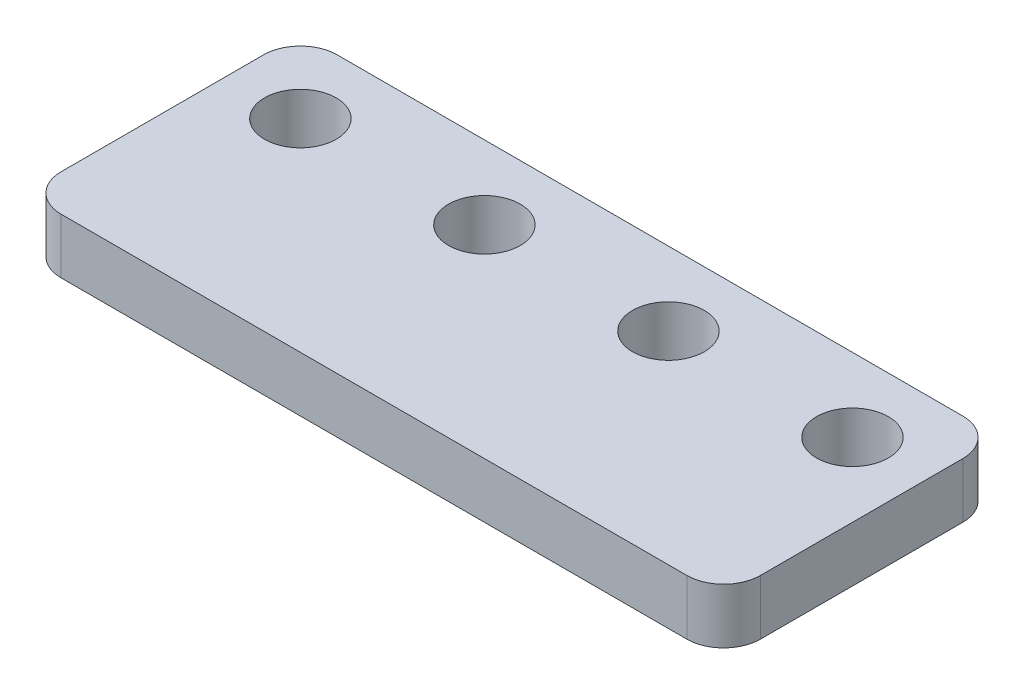
ISO-10303-21;
HEADER;
FILE_DESCRIPTION(('STEP AP214'),'2;1');
FILE_NAME('part.step','',(''),(''),'','','');
FILE_SCHEMA(('AUTOMOTIVE_DESIGN { 1 0 10303 214 1 1 1 1 }'));
ENDSEC;
DATA;
#1=APPLICATION_CONTEXT('core data for automotive mechanical design processes');
#2=APPLICATION_PROTOCOL_DEFINITION('international standard','automotive_design',2000,#1);
#3=PRODUCT_CONTEXT('',#1,'mechanical');
#4=PRODUCT('Part','Part','',(#3));
#5=PRODUCT_RELATED_PRODUCT_CATEGORY('part','',(#4));
#6=PRODUCT_DEFINITION_FORMATION('','',#4);
#7=PRODUCT_DEFINITION_CONTEXT('part definition',#1,'design');
#8=PRODUCT_DEFINITION('design','',#6,#7);
#9=PRODUCT_DEFINITION_SHAPE('','',#8);
#10=(LENGTH_UNIT() NAMED_UNIT(*) SI_UNIT(.MILLI.,.METRE.));
#11=(NAMED_UNIT(*) PLANE_ANGLE_UNIT() SI_UNIT($,.RADIAN.));
#12=(NAMED_UNIT(*) SI_UNIT($,.STERADIAN.) SOLID_ANGLE_UNIT());
#13=UNCERTAINTY_MEASURE_WITH_UNIT(LENGTH_MEASURE(1.E-05),#10,'distance_accuracy_value','');
#14=(GEOMETRIC_REPRESENTATION_CONTEXT(3) GLOBAL_UNCERTAINTY_ASSIGNED_CONTEXT((#13)) GLOBAL_UNIT_ASSIGNED_CONTEXT((#10,
#11,#12)) REPRESENTATION_CONTEXT('',''));
#15=CARTESIAN_POINT('',(0.,0.,0.));
#16=DIRECTION('',(0.,0.,1.));
#17=DIRECTION('',(1.,0.,0.));
#18=AXIS2_PLACEMENT_3D('',#15,#16,#17);
#19=CARTESIAN_POINT('',(-2.,3.,13.));
#20=DIRECTION('',(0.,-1.,0.));
#21=DIRECTION('',(0.,0.,-1.));
#22=AXIS2_PLACEMENT_3D('',#19,#20,#21);
#23=CYLINDRICAL_SURFACE('',#22,2.);
#24=CARTESIAN_POINT('',(-2.,0.,13.));
#25=DIRECTION('',(0.,1.,0.));
#26=DIRECTION('',(0.,0.,1.));
#27=AXIS2_PLACEMENT_3D('',#24,#25,#26);
#28=CIRCLE('',#27,2.);
#29=CARTESIAN_POINT('',(-2.,0.,15.));
#30=VERTEX_POINT('',#29);
#31=CARTESIAN_POINT('',(0.,0.,13.));
#32=VERTEX_POINT('',#31);
#33=EDGE_CURVE('E129',#30,#32,#28,.T.);
#34=ORIENTED_EDGE('',*,*,#33,.T.);
#35=DIRECTION('',(0.,-1.,0.));
#36=VECTOR('',#35,1.);
#37=CARTESIAN_POINT('',(0.,3.,13.));
#38=LINE('',#37,#36);
#39=CARTESIAN_POINT('',(0.,3.,13.));
#40=VERTEX_POINT('',#39);
#41=EDGE_CURVE('E11',#40,#32,#38,.T.);
#42=ORIENTED_EDGE('',*,*,#41,.F.);
#43=CARTESIAN_POINT('',(-2.,3.,13.));
#44=DIRECTION('',(0.,1.,0.));
#45=DIRECTION('',(0.,0.,1.));
#46=AXIS2_PLACEMENT_3D('',#43,#44,#45);
#47=CIRCLE('',#46,2.);
#48=CARTESIAN_POINT('',(-2.,3.,15.));
#49=VERTEX_POINT('',#48);
#50=EDGE_CURVE('E144',#49,#40,#47,.T.);
#51=ORIENTED_EDGE('',*,*,#50,.F.);
#52=DIRECTION('',(0.,-1.,0.));
#53=VECTOR('',#52,1.);
#54=CARTESIAN_POINT('',(-2.,3.,15.));
#55=LINE('',#54,#53);
#56=EDGE_CURVE('E125',#49,#30,#55,.T.);
#57=ORIENTED_EDGE('',*,*,#56,.T.);
#58=EDGE_LOOP('',(#34,#42,#51,#57));
#59=FACE_BOUND('',#58,.T.);
#60=ADVANCED_FACE('F33',(#59),#23,.T.);
#61=CARTESIAN_POINT('',(0.,3.,2.));
#62=DIRECTION('',(-1.,0.,0.));
#63=DIRECTION('',(0.,0.,1.));
#64=AXIS2_PLACEMENT_3D('',#61,#62,#63);
#65=PLANE('',#64);
#66=DIRECTION('',(0.,0.,-1.));
#67=VECTOR('',#66,1.);
#68=CARTESIAN_POINT('',(0.,0.,2.));
#69=LINE('',#68,#67);
#70=CARTESIAN_POINT('',(0.,0.,2.));
#71=VERTEX_POINT('',#70);
#72=EDGE_CURVE('E132',#32,#71,#69,.T.);
#73=ORIENTED_EDGE('',*,*,#72,.T.);
#74=DIRECTION('',(0.,-1.,0.));
#75=VECTOR('',#74,1.);
#76=CARTESIAN_POINT('',(0.,3.,2.));
#77=LINE('',#76,#75);
#78=CARTESIAN_POINT('',(0.,3.,2.));
#79=VERTEX_POINT('',#78);
#80=EDGE_CURVE('E41',#79,#71,#77,.T.);
#81=ORIENTED_EDGE('',*,*,#80,.F.);
#82=DIRECTION('',(0.,0.,-1.));
#83=VECTOR('',#82,1.);
#84=CARTESIAN_POINT('',(0.,3.,2.));
#85=LINE('',#84,#83);
#86=EDGE_CURVE('E92',#40,#79,#85,.T.);
#87=ORIENTED_EDGE('',*,*,#86,.F.);
#88=ORIENTED_EDGE('',*,*,#41,.T.);
#89=EDGE_LOOP('',(#73,#81,#87,#88));
#90=FACE_BOUND('',#89,.T.);
#91=ADVANCED_FACE('F235',(#90),#65,.F.);
#92=CARTESIAN_POINT('',(-2.,3.,2.));
#93=DIRECTION('',(0.,-1.,0.));
#94=DIRECTION('',(0.,0.,-1.));
#95=AXIS2_PLACEMENT_3D('',#92,#93,#94);
#96=CYLINDRICAL_SURFACE('',#95,2.);
#97=CARTESIAN_POINT('',(-2.,0.,2.));
#98=DIRECTION('',(0.,1.,0.));
#99=DIRECTION('',(0.,0.,-1.));
#100=AXIS2_PLACEMENT_3D('',#97,#98,#99);
#101=CIRCLE('',#100,2.);
#102=CARTESIAN_POINT('',(-2.,0.,0.));
#103=VERTEX_POINT('',#102);
#104=EDGE_CURVE('E135',#71,#103,#101,.T.);
#105=ORIENTED_EDGE('',*,*,#104,.T.);
#106=DIRECTION('',(0.,-1.,0.));
#107=VECTOR('',#106,1.);
#108=CARTESIAN_POINT('',(-2.,3.,0.));
#109=LINE('',#108,#107);
#110=CARTESIAN_POINT('',(-2.,3.,0.));
#111=VERTEX_POINT('',#110);
#112=EDGE_CURVE('E151',#111,#103,#109,.T.);
#113=ORIENTED_EDGE('',*,*,#112,.F.);
#114=CARTESIAN_POINT('',(-2.,3.,2.));
#115=DIRECTION('',(0.,1.,0.));
#116=DIRECTION('',(0.,0.,-1.));
#117=AXIS2_PLACEMENT_3D('',#114,#115,#116);
#118=CIRCLE('',#117,2.);
#119=EDGE_CURVE('E159',#79,#111,#118,.T.);
#120=ORIENTED_EDGE('',*,*,#119,.F.);
#121=ORIENTED_EDGE('',*,*,#80,.T.);
#122=EDGE_LOOP('',(#105,#113,#120,#121));
#123=FACE_BOUND('',#122,.T.);
#124=ADVANCED_FACE('F157',(#123),#96,.T.);
#125=CARTESIAN_POINT('',(-36.,3.,0.));
#126=DIRECTION('',(0.,0.,1.));
#127=DIRECTION('',(1.,0.,0.));
#128=AXIS2_PLACEMENT_3D('',#125,#126,#127);
#129=PLANE('',#128);
#130=DIRECTION('',(-1.,0.,0.));
#131=VECTOR('',#130,1.);
#132=CARTESIAN_POINT('',(-36.,0.,0.));
#133=LINE('',#132,#131);
#134=CARTESIAN_POINT('',(-36.,0.,0.));
#135=VERTEX_POINT('',#134);
#136=EDGE_CURVE('E137',#103,#135,#133,.T.);
#137=ORIENTED_EDGE('',*,*,#136,.T.);
#138=DIRECTION('',(0.,-1.,0.));
#139=VECTOR('',#138,1.);
#140=CARTESIAN_POINT('',(-36.,3.,0.));
#141=LINE('',#140,#139);
#142=CARTESIAN_POINT('',(-36.,3.,0.));
#143=VERTEX_POINT('',#142);
#144=EDGE_CURVE('E148',#143,#135,#141,.T.);
#145=ORIENTED_EDGE('',*,*,#144,.F.);
#146=DIRECTION('',(-1.,0.,0.));
#147=VECTOR('',#146,1.);
#148=CARTESIAN_POINT('',(-36.,3.,0.));
#149=LINE('',#148,#147);
#150=EDGE_CURVE('E171',#111,#143,#149,.T.);
#151=ORIENTED_EDGE('',*,*,#150,.F.);
#152=ORIENTED_EDGE('',*,*,#112,.T.);
#153=EDGE_LOOP('',(#137,#145,#151,#152));
#154=FACE_BOUND('',#153,.T.);
#155=ADVANCED_FACE('F167',(#154),#129,.F.);
#156=CARTESIAN_POINT('',(-36.,3.,2.));
#157=DIRECTION('',(0.,-1.,0.));
#158=DIRECTION('',(0.,0.,-1.));
#159=AXIS2_PLACEMENT_3D('',#156,#157,#158);
#160=CYLINDRICAL_SURFACE('',#159,2.);
#161=CARTESIAN_POINT('',(-36.,0.,2.));
#162=DIRECTION('',(0.,1.,0.));
#163=DIRECTION('',(0.,0.,1.));
#164=AXIS2_PLACEMENT_3D('',#161,#162,#163);
#165=CIRCLE('',#164,2.);
#166=CARTESIAN_POINT('',(-38.,0.,2.));
#167=VERTEX_POINT('',#166);
#168=EDGE_CURVE('E139',#135,#167,#165,.T.);
#169=ORIENTED_EDGE('',*,*,#168,.T.);
#170=DIRECTION('',(0.,-1.,0.));
#171=VECTOR('',#170,1.);
#172=CARTESIAN_POINT('',(-38.,3.,2.));
#173=LINE('',#172,#171);
#174=CARTESIAN_POINT('',(-38.,3.,2.));
#175=VERTEX_POINT('',#174);
#176=EDGE_CURVE('E120',#175,#167,#173,.T.);
#177=ORIENTED_EDGE('',*,*,#176,.F.);
#178=CARTESIAN_POINT('',(-36.,3.,2.));
#179=DIRECTION('',(0.,1.,0.));
#180=DIRECTION('',(0.,0.,1.));
#181=AXIS2_PLACEMENT_3D('',#178,#179,#180);
#182=CIRCLE('',#181,2.);
#183=EDGE_CURVE('E111',#143,#175,#182,.T.);
#184=ORIENTED_EDGE('',*,*,#183,.F.);
#185=ORIENTED_EDGE('',*,*,#144,.T.);
#186=EDGE_LOOP('',(#169,#177,#184,#185));
#187=FACE_BOUND('',#186,.T.);
#188=ADVANCED_FACE('F170',(#187),#160,.T.);
#189=CARTESIAN_POINT('',(-38.,3.,2.));
#190=DIRECTION('',(1.,0.,0.));
#191=DIRECTION('',(0.,0.,-1.));
#192=AXIS2_PLACEMENT_3D('',#189,#190,#191);
#193=PLANE('',#192);
#194=DIRECTION('',(0.,0.,1.));
#195=VECTOR('',#194,1.);
#196=CARTESIAN_POINT('',(-38.,0.,2.));
#197=LINE('',#196,#195);
#198=CARTESIAN_POINT('',(-38.,0.,13.));
#199=VERTEX_POINT('',#198);
#200=EDGE_CURVE('E119',#167,#199,#197,.T.);
#201=ORIENTED_EDGE('',*,*,#200,.T.);
#202=DIRECTION('',(0.,-1.,0.));
#203=VECTOR('',#202,1.);
#204=CARTESIAN_POINT('',(-38.,3.,13.));
#205=LINE('',#204,#203);
#206=CARTESIAN_POINT('',(-38.,3.,13.));
#207=VERTEX_POINT('',#206);
#208=EDGE_CURVE('E116',#207,#199,#205,.T.);
#209=ORIENTED_EDGE('',*,*,#208,.F.);
#210=DIRECTION('',(0.,0.,1.));
#211=VECTOR('',#210,1.);
#212=CARTESIAN_POINT('',(-38.,3.,2.));
#213=LINE('',#212,#211);
#214=EDGE_CURVE('E105',#175,#207,#213,.T.);
#215=ORIENTED_EDGE('',*,*,#214,.F.);
#216=ORIENTED_EDGE('',*,*,#176,.T.);
#217=EDGE_LOOP('',(#201,#209,#215,#216));
#218=FACE_BOUND('',#217,.T.);
#219=ADVANCED_FACE('F117',(#218),#193,.F.);
#220=CARTESIAN_POINT('',(-36.,3.,13.));
#221=DIRECTION('',(0.,-1.,0.));
#222=DIRECTION('',(0.,0.,-1.));
#223=AXIS2_PLACEMENT_3D('',#220,#221,#222);
#224=CYLINDRICAL_SURFACE('',#223,2.);
#225=CARTESIAN_POINT('',(-36.,0.,13.));
#226=DIRECTION('',(0.,1.,0.));
#227=DIRECTION('',(0.,0.,1.));
#228=AXIS2_PLACEMENT_3D('',#225,#226,#227);
#229=CIRCLE('',#228,2.);
#230=CARTESIAN_POINT('',(-36.,0.,15.));
#231=VERTEX_POINT('',#230);
#232=EDGE_CURVE('E78',#199,#231,#229,.T.);
#233=ORIENTED_EDGE('',*,*,#232,.T.);
#234=DIRECTION('',(0.,-1.,0.));
#235=VECTOR('',#234,1.);
#236=CARTESIAN_POINT('',(-36.,3.,15.));
#237=LINE('',#236,#235);
#238=CARTESIAN_POINT('',(-36.,3.,15.));
#239=VERTEX_POINT('',#238);
#240=EDGE_CURVE('E121',#239,#231,#237,.T.);
#241=ORIENTED_EDGE('',*,*,#240,.F.);
#242=CARTESIAN_POINT('',(-36.,3.,13.));
#243=DIRECTION('',(0.,1.,0.));
#244=DIRECTION('',(0.,0.,1.));
#245=AXIS2_PLACEMENT_3D('',#242,#243,#244);
#246=CIRCLE('',#245,2.);
#247=EDGE_CURVE('E109',#207,#239,#246,.T.);
#248=ORIENTED_EDGE('',*,*,#247,.F.);
#249=ORIENTED_EDGE('',*,*,#208,.T.);
#250=EDGE_LOOP('',(#233,#241,#248,#249));
#251=FACE_BOUND('',#250,.T.);
#252=ADVANCED_FACE('F123',(#251),#224,.T.);
#253=CARTESIAN_POINT('',(-36.,3.,15.));
#254=DIRECTION('',(0.,0.,-1.));
#255=DIRECTION('',(-1.,0.,0.));
#256=AXIS2_PLACEMENT_3D('',#253,#254,#255);
#257=PLANE('',#256);
#258=DIRECTION('',(1.,0.,0.));
#259=VECTOR('',#258,1.);
#260=CARTESIAN_POINT('',(-36.,0.,15.));
#261=LINE('',#260,#259);
#262=EDGE_CURVE('E84',#231,#30,#261,.T.);
#263=ORIENTED_EDGE('',*,*,#262,.T.);
#264=ORIENTED_EDGE('',*,*,#56,.F.);
#265=DIRECTION('',(1.,0.,0.));
#266=VECTOR('',#265,1.);
#267=CARTESIAN_POINT('',(-36.,3.,15.));
#268=LINE('',#267,#266);
#269=EDGE_CURVE('E49',#239,#49,#268,.T.);
#270=ORIENTED_EDGE('',*,*,#269,.F.);
#271=ORIENTED_EDGE('',*,*,#240,.T.);
#272=EDGE_LOOP('',(#263,#264,#270,#271));
#273=FACE_BOUND('',#272,.T.);
#274=ADVANCED_FACE('F212',(#273),#257,.F.);
#275=CARTESIAN_POINT('',(-2.,3.,13.));
#276=DIRECTION('',(0.,1.,0.));
#277=DIRECTION('',(0.,0.,1.));
#278=AXIS2_PLACEMENT_3D('',#275,#276,#277);
#279=PLANE('',#278);
#280=CARTESIAN_POINT('',(-4.,3.,4.));
#281=DIRECTION('',(0.,1.,0.));
#282=DIRECTION('',(0.,0.,1.));
#283=AXIS2_PLACEMENT_3D('',#280,#281,#282);
#284=CIRCLE('',#283,1.95);
#285=CARTESIAN_POINT('',(-4.,3.,5.95));
#286=VERTEX_POINT('',#285);
#287=EDGE_CURVE('E190',#286,#286,#284,.T.);
#288=ORIENTED_EDGE('',*,*,#287,.F.);
#289=EDGE_LOOP('',(#288));
#290=FACE_BOUND('',#289,.T.);
#291=CARTESIAN_POINT('',(-34.,3.,4.));
#292=DIRECTION('',(0.,1.,0.));
#293=DIRECTION('',(0.,0.,1.));
#294=AXIS2_PLACEMENT_3D('',#291,#292,#293);
#295=CIRCLE('',#294,1.95);
#296=CARTESIAN_POINT('',(-34.,3.,5.95));
#297=VERTEX_POINT('',#296);
#298=EDGE_CURVE('E191',#297,#297,#295,.T.);
#299=ORIENTED_EDGE('',*,*,#298,.F.);
#300=EDGE_LOOP('',(#299));
#301=FACE_BOUND('',#300,.T.);
#302=CARTESIAN_POINT('',(-24.,3.,4.));
#303=DIRECTION('',(0.,1.,0.));
#304=DIRECTION('',(0.,0.,1.));
#305=AXIS2_PLACEMENT_3D('',#302,#303,#304);
#306=CIRCLE('',#305,1.95);
#307=CARTESIAN_POINT('',(-24.,3.,5.95));
#308=VERTEX_POINT('',#307);
#309=EDGE_CURVE('E177',#308,#308,#306,.T.);
#310=ORIENTED_EDGE('',*,*,#309,.F.);
#311=EDGE_LOOP('',(#310));
#312=FACE_BOUND('',#311,.T.);
#313=CARTESIAN_POINT('',(-14.,3.,4.));
#314=DIRECTION('',(0.,1.,0.));
#315=DIRECTION('',(0.,0.,1.));
#316=AXIS2_PLACEMENT_3D('',#313,#314,#315);
#317=CIRCLE('',#316,1.95);
#318=CARTESIAN_POINT('',(-14.,3.,5.95));
#319=VERTEX_POINT('',#318);
#320=EDGE_CURVE('E184',#319,#319,#317,.T.);
#321=ORIENTED_EDGE('',*,*,#320,.F.);
#322=EDGE_LOOP('',(#321));
#323=FACE_BOUND('',#322,.T.);
#324=ORIENTED_EDGE('',*,*,#50,.T.);
#325=ORIENTED_EDGE('',*,*,#86,.T.);
#326=ORIENTED_EDGE('',*,*,#119,.T.);
#327=ORIENTED_EDGE('',*,*,#150,.T.);
#328=ORIENTED_EDGE('',*,*,#183,.T.);
#329=ORIENTED_EDGE('',*,*,#214,.T.);
#330=ORIENTED_EDGE('',*,*,#247,.T.);
#331=ORIENTED_EDGE('',*,*,#269,.T.);
#332=EDGE_LOOP('',(#324,#325,#326,#327,#328,#329,#330,#331));
#333=FACE_BOUND('',#332,.T.);
#334=ADVANCED_FACE('F107',(#290,#301,#312,#323,#333),#279,.T.);
#335=CARTESIAN_POINT('',(-2.,0.,13.));
#336=DIRECTION('',(0.,1.,0.));
#337=DIRECTION('',(0.,0.,1.));
#338=AXIS2_PLACEMENT_3D('',#335,#336,#337);
#339=PLANE('',#338);
#340=CARTESIAN_POINT('',(-4.,0.,4.));
#341=DIRECTION('',(0.,1.,0.));
#342=DIRECTION('',(0.,0.,1.));
#343=AXIS2_PLACEMENT_3D('',#340,#341,#342);
#344=CIRCLE('',#343,1.95);
#345=CARTESIAN_POINT('',(-4.,0.,5.95));
#346=VERTEX_POINT('',#345);
#347=EDGE_CURVE('E133',#346,#346,#344,.T.);
#348=ORIENTED_EDGE('',*,*,#347,.T.);
#349=EDGE_LOOP('',(#348));
#350=FACE_BOUND('',#349,.T.);
#351=CARTESIAN_POINT('',(-34.,0.,4.));
#352=DIRECTION('',(0.,1.,0.));
#353=DIRECTION('',(0.,0.,1.));
#354=AXIS2_PLACEMENT_3D('',#351,#352,#353);
#355=CIRCLE('',#354,1.95);
#356=CARTESIAN_POINT('',(-34.,0.,5.95));
#357=VERTEX_POINT('',#356);
#358=EDGE_CURVE('E181',#357,#357,#355,.T.);
#359=ORIENTED_EDGE('',*,*,#358,.T.);
#360=EDGE_LOOP('',(#359));
#361=FACE_BOUND('',#360,.T.);
#362=CARTESIAN_POINT('',(-24.,0.,4.));
#363=DIRECTION('',(0.,1.,0.));
#364=DIRECTION('',(0.,0.,1.));
#365=AXIS2_PLACEMENT_3D('',#362,#363,#364);
#366=CIRCLE('',#365,1.95);
#367=CARTESIAN_POINT('',(-24.,0.,5.95));
#368=VERTEX_POINT('',#367);
#369=EDGE_CURVE('E180',#368,#368,#366,.T.);
#370=ORIENTED_EDGE('',*,*,#369,.T.);
#371=EDGE_LOOP('',(#370));
#372=FACE_BOUND('',#371,.T.);
#373=CARTESIAN_POINT('',(-14.,0.,4.));
#374=DIRECTION('',(0.,1.,0.));
#375=DIRECTION('',(0.,0.,1.));
#376=AXIS2_PLACEMENT_3D('',#373,#374,#375);
#377=CIRCLE('',#376,1.95);
#378=CARTESIAN_POINT('',(-14.,0.,5.95));
#379=VERTEX_POINT('',#378);
#380=EDGE_CURVE('E187',#379,#379,#377,.T.);
#381=ORIENTED_EDGE('',*,*,#380,.T.);
#382=EDGE_LOOP('',(#381));
#383=FACE_BOUND('',#382,.T.);
#384=ORIENTED_EDGE('',*,*,#33,.F.);
#385=ORIENTED_EDGE('',*,*,#262,.F.);
#386=ORIENTED_EDGE('',*,*,#232,.F.);
#387=ORIENTED_EDGE('',*,*,#200,.F.);
#388=ORIENTED_EDGE('',*,*,#168,.F.);
#389=ORIENTED_EDGE('',*,*,#136,.F.);
#390=ORIENTED_EDGE('',*,*,#104,.F.);
#391=ORIENTED_EDGE('',*,*,#72,.F.);
#392=EDGE_LOOP('',(#384,#385,#386,#387,#388,#389,#390,#391));
#393=FACE_BOUND('',#392,.T.);
#394=ADVANCED_FACE('F163',(#350,#361,#372,#383,#393),#339,.F.);
#395=CARTESIAN_POINT('',(-14.,0.,4.));
#396=DIRECTION('',(0.,1.,0.));
#397=DIRECTION('',(0.,0.,1.));
#398=AXIS2_PLACEMENT_3D('',#395,#396,#397);
#399=CYLINDRICAL_SURFACE('',#398,1.95);
#400=ORIENTED_EDGE('',*,*,#380,.F.);
#401=EDGE_LOOP('',(#400));
#402=FACE_BOUND('',#401,.T.);
#403=ORIENTED_EDGE('',*,*,#320,.T.);
#404=EDGE_LOOP('',(#403));
#405=FACE_BOUND('',#404,.T.);
#406=ADVANCED_FACE('F220',(#402,#405),#399,.F.);
#407=CARTESIAN_POINT('',(-24.,0.,4.));
#408=DIRECTION('',(0.,1.,0.));
#409=DIRECTION('',(0.,0.,1.));
#410=AXIS2_PLACEMENT_3D('',#407,#408,#409);
#411=CYLINDRICAL_SURFACE('',#410,1.95);
#412=ORIENTED_EDGE('',*,*,#369,.F.);
#413=EDGE_LOOP('',(#412));
#414=FACE_BOUND('',#413,.T.);
#415=ORIENTED_EDGE('',*,*,#309,.T.);
#416=EDGE_LOOP('',(#415));
#417=FACE_BOUND('',#416,.T.);
#418=ADVANCED_FACE('F222',(#414,#417),#411,.F.);
#419=CARTESIAN_POINT('',(-34.,0.,4.));
#420=DIRECTION('',(0.,1.,0.));
#421=DIRECTION('',(0.,0.,1.));
#422=AXIS2_PLACEMENT_3D('',#419,#420,#421);
#423=CYLINDRICAL_SURFACE('',#422,1.95);
#424=ORIENTED_EDGE('',*,*,#358,.F.);
#425=EDGE_LOOP('',(#424));
#426=FACE_BOUND('',#425,.T.);
#427=ORIENTED_EDGE('',*,*,#298,.T.);
#428=EDGE_LOOP('',(#427));
#429=FACE_BOUND('',#428,.T.);
#430=ADVANCED_FACE('F206',(#426,#429),#423,.F.);
#431=CARTESIAN_POINT('',(-4.,0.,4.));
#432=DIRECTION('',(0.,1.,0.));
#433=DIRECTION('',(0.,0.,1.));
#434=AXIS2_PLACEMENT_3D('',#431,#432,#433);
#435=CYLINDRICAL_SURFACE('',#434,1.95);
#436=ORIENTED_EDGE('',*,*,#347,.F.);
#437=EDGE_LOOP('',(#436));
#438=FACE_BOUND('',#437,.T.);
#439=ORIENTED_EDGE('',*,*,#287,.T.);
#440=EDGE_LOOP('',(#439));
#441=FACE_BOUND('',#440,.T.);
#442=ADVANCED_FACE('F203',(#438,#441),#435,.F.);
#443=CLOSED_SHELL('',(#60,#91,#124,#155,#188,#219,#252,#274,#334,#394,#406,#418,#430,#442));
#444=MANIFOLD_SOLID_BREP('B2',#443);
#445=ADVANCED_BREP_SHAPE_REPRESENTATION('',(#18,#444),#14);
#446=SHAPE_DEFINITION_REPRESENTATION(#9,#445);
ENDSEC;
END-ISO-10303-21;
